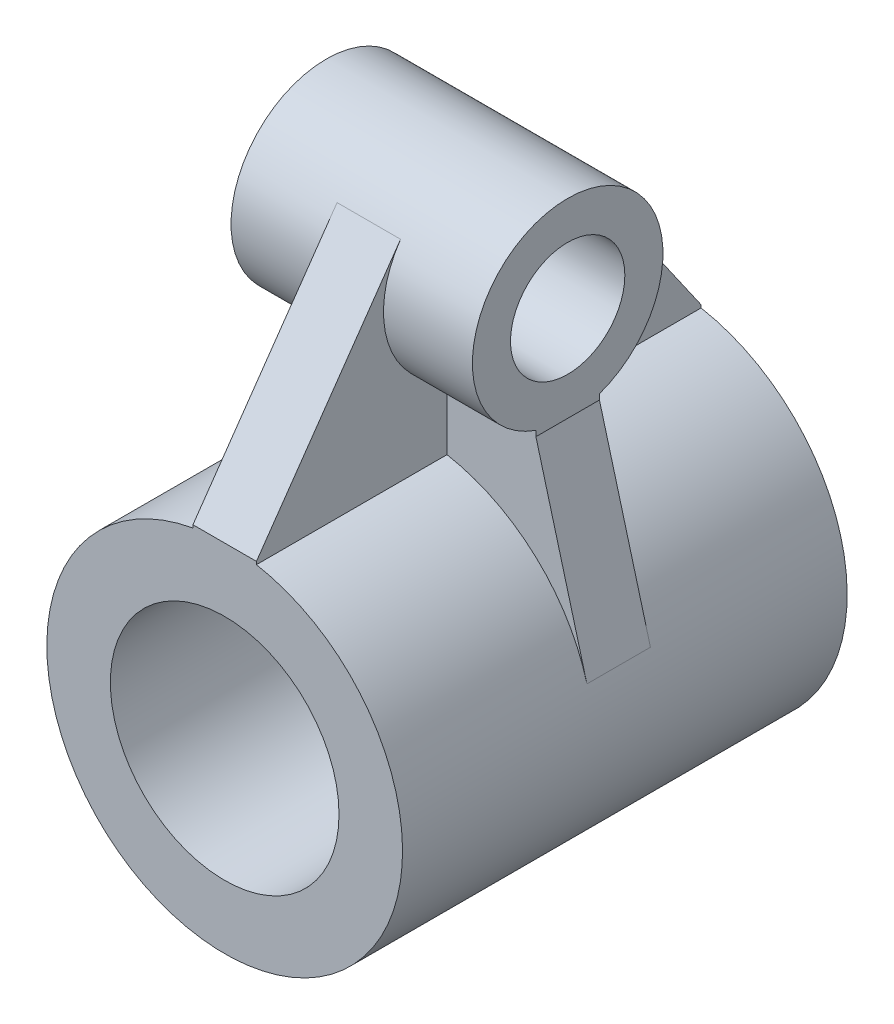
ISO-10303-21;
HEADER;
FILE_DESCRIPTION(('STEP AP214'),'2;1');
FILE_NAME('part.step','',(''),(''),'','','');
FILE_SCHEMA(('AUTOMOTIVE_DESIGN { 1 0 10303 214 1 1 1 1 }'));
ENDSEC;
DATA;
#1=APPLICATION_CONTEXT('core data for automotive mechanical design processes');
#2=APPLICATION_PROTOCOL_DEFINITION('international standard','automotive_design',2000,#1);
#3=PRODUCT_CONTEXT('',#1,'mechanical');
#4=PRODUCT('Part','Part','',(#3));
#5=PRODUCT_RELATED_PRODUCT_CATEGORY('part','',(#4));
#6=PRODUCT_DEFINITION_FORMATION('','',#4);
#7=PRODUCT_DEFINITION_CONTEXT('part definition',#1,'design');
#8=PRODUCT_DEFINITION('design','',#6,#7);
#9=PRODUCT_DEFINITION_SHAPE('','',#8);
#10=(LENGTH_UNIT() NAMED_UNIT(*) SI_UNIT(.MILLI.,.METRE.));
#11=(NAMED_UNIT(*) PLANE_ANGLE_UNIT() SI_UNIT($,.RADIAN.));
#12=(NAMED_UNIT(*) SI_UNIT($,.STERADIAN.) SOLID_ANGLE_UNIT());
#13=UNCERTAINTY_MEASURE_WITH_UNIT(LENGTH_MEASURE(1.E-05),#10,'distance_accuracy_value','');
#14=(GEOMETRIC_REPRESENTATION_CONTEXT(3) GLOBAL_UNCERTAINTY_ASSIGNED_CONTEXT((#13)) GLOBAL_UNIT_ASSIGNED_CONTEXT((#10,
#11,#12)) REPRESENTATION_CONTEXT('',''));
#15=CARTESIAN_POINT('',(0.,0.,0.));
#16=DIRECTION('',(0.,0.,1.));
#17=DIRECTION('',(1.,0.,0.));
#18=AXIS2_PLACEMENT_3D('',#15,#16,#17);
#19=CARTESIAN_POINT('',(2.5,26.,0.));
#20=DIRECTION('',(1.,0.,0.));
#21=DIRECTION('',(0.,0.,-1.));
#22=AXIS2_PLACEMENT_3D('',#19,#20,#21);
#23=PLANE('',#22);
#24=CARTESIAN_POINT('',(2.5,26.,0.));
#25=DIRECTION('',(-1.,0.,0.));
#26=DIRECTION('',(0.,0.,-1.));
#27=AXIS2_PLACEMENT_3D('',#24,#25,#26);
#28=CIRCLE('',#27,7.49999999999999);
#29=CARTESIAN_POINT('',(2.5,30.2870363418499,-6.15396777726847));
#30=VERTEX_POINT('',#29);
#31=CARTESIAN_POINT('',(2.5,18.9289321881345,-2.5));
#32=VERTEX_POINT('',#31);
#33=EDGE_CURVE('E227',#30,#32,#28,.T.);
#34=ORIENTED_EDGE('',*,*,#33,.T.);
#35=DIRECTION('',(0.,-1.,0.));
#36=VECTOR('',#35,1.);
#37=CARTESIAN_POINT('',(2.5,26.,-2.5));
#38=LINE('',#37,#36);
#39=CARTESIAN_POINT('',(2.5,13.7749773139559,-2.5));
#40=VERTEX_POINT('',#39);
#41=EDGE_CURVE('E160',#32,#40,#38,.T.);
#42=ORIENTED_EDGE('',*,*,#41,.T.);
#43=DIRECTION('',(0.,0.,-1.));
#44=VECTOR('',#43,1.);
#45=CARTESIAN_POINT('',(2.5,13.7749773139559,17.5));
#46=LINE('',#45,#44);
#47=CARTESIAN_POINT('',(2.5,13.7749773139559,-17.5));
#48=VERTEX_POINT('',#47);
#49=EDGE_CURVE('E271',#48,#40,#46,.F.);
#50=ORIENTED_EDGE('',*,*,#49,.F.);
#51=DIRECTION('',(0.,1.,0.));
#52=VECTOR('',#51,1.);
#53=CARTESIAN_POINT('',(2.5,14.,-17.5));
#54=LINE('',#53,#52);
#55=CARTESIAN_POINT('',(2.5,14.,-17.5));
#56=VERTEX_POINT('',#55);
#57=EDGE_CURVE('E220',#48,#56,#54,.T.);
#58=ORIENTED_EDGE('',*,*,#57,.T.);
#59=DIRECTION('',(0.,0.820529036969129,0.571604845579981));
#60=VECTOR('',#59,1.);
#61=CARTESIAN_POINT('',(2.5,14.,-17.5));
#62=LINE('',#61,#60);
#63=EDGE_CURVE('E223',#56,#30,#62,.T.);
#64=ORIENTED_EDGE('',*,*,#63,.T.);
#65=EDGE_LOOP('',(#34,#42,#50,#58,#64));
#66=FACE_BOUND('',#65,.T.);
#67=ADVANCED_FACE('F39',(#66),#23,.T.);
#68=CARTESIAN_POINT('',(-2.5,26.,0.));
#69=DIRECTION('',(1.,0.,0.));
#70=DIRECTION('',(0.,0.,-1.));
#71=AXIS2_PLACEMENT_3D('',#68,#69,#70);
#72=PLANE('',#71);
#73=DIRECTION('',(0.,-1.,0.));
#74=VECTOR('',#73,1.);
#75=CARTESIAN_POINT('',(-2.5,26.,-2.5));
#76=LINE('',#75,#74);
#77=CARTESIAN_POINT('',(-2.5,18.9289321881345,-2.5));
#78=VERTEX_POINT('',#77);
#79=CARTESIAN_POINT('',(-2.5,13.7749773139559,-2.5));
#80=VERTEX_POINT('',#79);
#81=EDGE_CURVE('E200',#78,#80,#76,.T.);
#82=ORIENTED_EDGE('',*,*,#81,.F.);
#83=CARTESIAN_POINT('',(-2.5,26.,0.));
#84=DIRECTION('',(-1.,0.,0.));
#85=DIRECTION('',(0.,0.,-1.));
#86=AXIS2_PLACEMENT_3D('',#83,#84,#85);
#87=CIRCLE('',#86,7.49999999999999);
#88=CARTESIAN_POINT('',(-2.5,30.2870363418499,-6.15396777726847));
#89=VERTEX_POINT('',#88);
#90=EDGE_CURVE('E243',#89,#78,#87,.T.);
#91=ORIENTED_EDGE('',*,*,#90,.F.);
#92=DIRECTION('',(0.,0.820529036969129,0.571604845579981));
#93=VECTOR('',#92,1.);
#94=CARTESIAN_POINT('',(-2.5,14.,-17.5));
#95=LINE('',#94,#93);
#96=CARTESIAN_POINT('',(-2.5,14.,-17.5));
#97=VERTEX_POINT('',#96);
#98=EDGE_CURVE('E239',#97,#89,#95,.T.);
#99=ORIENTED_EDGE('',*,*,#98,.F.);
#100=DIRECTION('',(0.,1.,0.));
#101=VECTOR('',#100,1.);
#102=CARTESIAN_POINT('',(-2.5,14.,-17.5));
#103=LINE('',#102,#101);
#104=CARTESIAN_POINT('',(-2.5,13.7749773139559,-17.5));
#105=VERTEX_POINT('',#104);
#106=EDGE_CURVE('E236',#105,#97,#103,.T.);
#107=ORIENTED_EDGE('',*,*,#106,.F.);
#108=DIRECTION('',(0.,0.,-1.));
#109=VECTOR('',#108,1.);
#110=CARTESIAN_POINT('',(-2.5,13.7749773139559,17.5));
#111=LINE('',#110,#109);
#112=EDGE_CURVE('E267',#105,#80,#111,.F.);
#113=ORIENTED_EDGE('',*,*,#112,.T.);
#114=EDGE_LOOP('',(#82,#91,#99,#107,#113));
#115=FACE_BOUND('',#114,.T.);
#116=ADVANCED_FACE('F313',(#115),#72,.F.);
#117=CARTESIAN_POINT('',(0.,0.,17.5));
#118=DIRECTION('',(0.,0.,1.));
#119=DIRECTION('',(1.,0.,0.));
#120=AXIS2_PLACEMENT_3D('',#117,#118,#119);
#121=PLANE('',#120);
#122=CARTESIAN_POINT('',(0.,0.,17.5));
#123=DIRECTION('',(0.,0.,1.));
#124=DIRECTION('',(1.,0.,0.));
#125=AXIS2_PLACEMENT_3D('',#122,#123,#124);
#126=CIRCLE('',#125,9.00000000000001);
#127=CARTESIAN_POINT('',(9.00000000000001,0.,17.5));
#128=VERTEX_POINT('',#127);
#129=EDGE_CURVE('E256',#128,#128,#126,.T.);
#130=ORIENTED_EDGE('',*,*,#129,.F.);
#131=EDGE_LOOP('',(#130));
#132=FACE_BOUND('',#131,.T.);
#133=CARTESIAN_POINT('',(0.,0.,17.5));
#134=DIRECTION('',(0.,0.,1.));
#135=DIRECTION('',(1.,0.,0.));
#136=AXIS2_PLACEMENT_3D('',#133,#134,#135);
#137=CIRCLE('',#136,14.);
#138=CARTESIAN_POINT('',(-2.5,13.7749773139559,17.5));
#139=VERTEX_POINT('',#138);
#140=CARTESIAN_POINT('',(2.5,13.7749773139559,17.5));
#141=VERTEX_POINT('',#140);
#142=EDGE_CURVE('E262',#139,#141,#137,.T.);
#143=ORIENTED_EDGE('',*,*,#142,.T.);
#144=DIRECTION('',(0.,-1.,0.));
#145=VECTOR('',#144,1.);
#146=CARTESIAN_POINT('',(2.5,9.00000000000001,17.5));
#147=LINE('',#146,#145);
#148=CARTESIAN_POINT('',(2.5,14.,17.5));
#149=VERTEX_POINT('',#148);
#150=EDGE_CURVE('E217',#149,#141,#147,.T.);
#151=ORIENTED_EDGE('',*,*,#150,.F.);
#152=DIRECTION('',(-1.,0.,0.));
#153=VECTOR('',#152,1.);
#154=CARTESIAN_POINT('',(2.5,14.,17.5));
#155=LINE('',#154,#153);
#156=CARTESIAN_POINT('',(-2.5,14.,17.5));
#157=VERTEX_POINT('',#156);
#158=EDGE_CURVE('E233',#149,#157,#155,.T.);
#159=ORIENTED_EDGE('',*,*,#158,.T.);
#160=DIRECTION('',(0.,-1.,0.));
#161=VECTOR('',#160,1.);
#162=CARTESIAN_POINT('',(-2.5,9.00000000000001,17.5));
#163=LINE('',#162,#161);
#164=EDGE_CURVE('E215',#157,#139,#163,.T.);
#165=ORIENTED_EDGE('',*,*,#164,.T.);
#166=EDGE_LOOP('',(#143,#151,#159,#165));
#167=FACE_BOUND('',#166,.T.);
#168=ADVANCED_FACE('F291',(#132,#167),#121,.T.);
#169=CARTESIAN_POINT('',(0.,0.,-17.5));
#170=DIRECTION('',(0.,0.,1.));
#171=DIRECTION('',(1.,0.,0.));
#172=AXIS2_PLACEMENT_3D('',#169,#170,#171);
#173=PLANE('',#172);
#174=CARTESIAN_POINT('',(0.,0.,-17.5));
#175=DIRECTION('',(0.,0.,1.));
#176=DIRECTION('',(1.,0.,0.));
#177=AXIS2_PLACEMENT_3D('',#174,#175,#176);
#178=CIRCLE('',#177,9.00000000000001);
#179=CARTESIAN_POINT('',(9.00000000000001,0.,-17.5));
#180=VERTEX_POINT('',#179);
#181=EDGE_CURVE('E255',#180,#180,#178,.T.);
#182=ORIENTED_EDGE('',*,*,#181,.T.);
#183=EDGE_LOOP('',(#182));
#184=FACE_BOUND('',#183,.T.);
#185=ORIENTED_EDGE('',*,*,#57,.F.);
#186=CARTESIAN_POINT('',(0.,0.,-17.5));
#187=DIRECTION('',(0.,0.,1.));
#188=DIRECTION('',(1.,0.,0.));
#189=AXIS2_PLACEMENT_3D('',#186,#187,#188);
#190=CIRCLE('',#189,14.);
#191=EDGE_CURVE('E259',#105,#48,#190,.T.);
#192=ORIENTED_EDGE('',*,*,#191,.F.);
#193=ORIENTED_EDGE('',*,*,#106,.T.);
#194=DIRECTION('',(-1.,0.,0.));
#195=VECTOR('',#194,1.);
#196=CARTESIAN_POINT('',(2.5,14.,-17.5));
#197=LINE('',#196,#195);
#198=EDGE_CURVE('E253',#56,#97,#197,.T.);
#199=ORIENTED_EDGE('',*,*,#198,.F.);
#200=EDGE_LOOP('',(#185,#192,#193,#199));
#201=FACE_BOUND('',#200,.T.);
#202=ADVANCED_FACE('F350',(#184,#201),#173,.F.);
#203=CARTESIAN_POINT('',(0.,0.,17.5));
#204=DIRECTION('',(0.,0.,-1.));
#205=DIRECTION('',(-1.,0.,0.));
#206=AXIS2_PLACEMENT_3D('',#203,#204,#205);
#207=CYLINDRICAL_SURFACE('',#206,14.);
#208=DIRECTION('',(0.,0.,-1.));
#209=VECTOR('',#208,1.);
#210=CARTESIAN_POINT('',(13.5145575336428,3.65468667191319,2.5));
#211=LINE('',#210,#209);
#212=CARTESIAN_POINT('',(13.5145575336428,3.65468667191319,2.5));
#213=VERTEX_POINT('',#212);
#214=CARTESIAN_POINT('',(13.5145575336428,3.65468667191319,-2.5));
#215=VERTEX_POINT('',#214);
#216=EDGE_CURVE('E54',#213,#215,#211,.T.);
#217=ORIENTED_EDGE('',*,*,#216,.F.);
#218=CARTESIAN_POINT('',(0.,0.,2.5));
#219=DIRECTION('',(0.,0.,-1.));
#220=DIRECTION('',(1.,0.,0.));
#221=AXIS2_PLACEMENT_3D('',#218,#219,#220);
#222=CIRCLE('',#221,14.);
#223=CARTESIAN_POINT('',(2.5,13.7749773139559,2.5));
#224=VERTEX_POINT('',#223);
#225=EDGE_CURVE('E174',#224,#213,#222,.T.);
#226=ORIENTED_EDGE('',*,*,#225,.F.);
#227=EDGE_CURVE('E270',#224,#141,#46,.F.);
#228=ORIENTED_EDGE('',*,*,#227,.T.);
#229=ORIENTED_EDGE('',*,*,#142,.F.);
#230=CARTESIAN_POINT('',(-2.5,13.7749773139559,2.5));
#231=VERTEX_POINT('',#230);
#232=EDGE_CURVE('E265',#231,#139,#111,.F.);
#233=ORIENTED_EDGE('',*,*,#232,.F.);
#234=CARTESIAN_POINT('',(-13.5145575336428,3.6546866719132,2.5));
#235=VERTEX_POINT('',#234);
#236=EDGE_CURVE('E183',#235,#231,#222,.T.);
#237=ORIENTED_EDGE('',*,*,#236,.F.);
#238=DIRECTION('',(0.,0.,-1.));
#239=VECTOR('',#238,1.);
#240=CARTESIAN_POINT('',(-13.5145575336428,3.65468667191319,2.5));
#241=LINE('',#240,#239);
#242=CARTESIAN_POINT('',(-13.5145575336428,3.65468667191319,-2.5));
#243=VERTEX_POINT('',#242);
#244=EDGE_CURVE('E196',#235,#243,#241,.T.);
#245=ORIENTED_EDGE('',*,*,#244,.T.);
#246=CARTESIAN_POINT('',(0.,0.,-2.5));
#247=DIRECTION('',(0.,0.,-1.));
#248=DIRECTION('',(1.,0.,0.));
#249=AXIS2_PLACEMENT_3D('',#246,#247,#248);
#250=CIRCLE('',#249,14.);
#251=EDGE_CURVE('E175',#243,#80,#250,.T.);
#252=ORIENTED_EDGE('',*,*,#251,.T.);
#253=ORIENTED_EDGE('',*,*,#112,.F.);
#254=ORIENTED_EDGE('',*,*,#191,.T.);
#255=ORIENTED_EDGE('',*,*,#49,.T.);
#256=EDGE_CURVE('E59',#40,#215,#250,.T.);
#257=ORIENTED_EDGE('',*,*,#256,.T.);
#258=EDGE_LOOP('',(#217,#226,#228,#229,#233,#237,#245,#252,#253,#254,#255,#257));
#259=FACE_BOUND('',#258,.T.);
#260=ADVANCED_FACE('F41',(#259),#207,.T.);
#261=CARTESIAN_POINT('',(0.,0.,17.5));
#262=DIRECTION('',(0.,0.,-1.));
#263=DIRECTION('',(-1.,0.,0.));
#264=AXIS2_PLACEMENT_3D('',#261,#262,#263);
#265=CYLINDRICAL_SURFACE('',#264,9.00000000000001);
#266=ORIENTED_EDGE('',*,*,#181,.F.);
#267=EDGE_LOOP('',(#266));
#268=FACE_BOUND('',#267,.T.);
#269=ORIENTED_EDGE('',*,*,#129,.T.);
#270=EDGE_LOOP('',(#269));
#271=FACE_BOUND('',#270,.T.);
#272=ADVANCED_FACE('F337',(#268,#271),#265,.F.);
#273=DIRECTION('',(0.,-1.,0.));
#274=VECTOR('',#273,1.);
#275=CARTESIAN_POINT('',(2.5,26.,2.5));
#276=LINE('',#275,#274);
#277=CARTESIAN_POINT('',(2.5,18.9289321881345,2.5));
#278=VERTEX_POINT('',#277);
#279=EDGE_CURVE('E203',#278,#224,#276,.T.);
#280=ORIENTED_EDGE('',*,*,#279,.F.);
#281=CARTESIAN_POINT('',(2.5,30.2870363418499,6.15396777726847));
#282=VERTEX_POINT('',#281);
#283=EDGE_CURVE('E226',#278,#282,#28,.T.);
#284=ORIENTED_EDGE('',*,*,#283,.T.);
#285=DIRECTION('',(0.,-0.820529036969129,0.571604845579981));
#286=VECTOR('',#285,1.);
#287=CARTESIAN_POINT('',(2.5,14.,17.5));
#288=LINE('',#287,#286);
#289=EDGE_CURVE('E230',#282,#149,#288,.T.);
#290=ORIENTED_EDGE('',*,*,#289,.T.);
#291=ORIENTED_EDGE('',*,*,#150,.T.);
#292=ORIENTED_EDGE('',*,*,#227,.F.);
#293=EDGE_LOOP('',(#280,#284,#290,#291,#292));
#294=FACE_BOUND('',#293,.T.);
#295=ADVANCED_FACE('F286',(#294),#23,.T.);
#296=CARTESIAN_POINT('',(-2.5,18.9289321881345,2.5));
#297=VERTEX_POINT('',#296);
#298=CARTESIAN_POINT('',(-2.5,30.2870363418498,6.15396777726846));
#299=VERTEX_POINT('',#298);
#300=EDGE_CURVE('E242',#297,#299,#87,.T.);
#301=ORIENTED_EDGE('',*,*,#300,.F.);
#302=DIRECTION('',(0.,-1.,0.));
#303=VECTOR('',#302,1.);
#304=CARTESIAN_POINT('',(-2.5,26.,2.5));
#305=LINE('',#304,#303);
#306=EDGE_CURVE('E205',#297,#231,#305,.T.);
#307=ORIENTED_EDGE('',*,*,#306,.T.);
#308=ORIENTED_EDGE('',*,*,#232,.T.);
#309=ORIENTED_EDGE('',*,*,#164,.F.);
#310=DIRECTION('',(0.,-0.820529036969129,0.571604845579981));
#311=VECTOR('',#310,1.);
#312=CARTESIAN_POINT('',(-2.5,14.,17.5));
#313=LINE('',#312,#311);
#314=EDGE_CURVE('E221',#299,#157,#313,.T.);
#315=ORIENTED_EDGE('',*,*,#314,.F.);
#316=EDGE_LOOP('',(#301,#307,#308,#309,#315));
#317=FACE_BOUND('',#316,.T.);
#318=ADVANCED_FACE('F296',(#317),#72,.F.);
#319=CARTESIAN_POINT('',(2.5,14.,-17.5));
#320=DIRECTION('',(0.,-0.571604845579981,0.820529036969129));
#321=DIRECTION('',(0.,-0.820529036969129,-0.571604845579981));
#322=AXIS2_PLACEMENT_3D('',#319,#320,#321);
#323=PLANE('',#322);
#324=ORIENTED_EDGE('',*,*,#98,.T.);
#325=DIRECTION('',(-1.,0.,0.));
#326=VECTOR('',#325,1.);
#327=CARTESIAN_POINT('',(2.5,30.2870363418499,-6.15396777726846));
#328=LINE('',#327,#326);
#329=EDGE_CURVE('E251',#30,#89,#328,.T.);
#330=ORIENTED_EDGE('',*,*,#329,.F.);
#331=ORIENTED_EDGE('',*,*,#63,.F.);
#332=ORIENTED_EDGE('',*,*,#198,.T.);
#333=EDGE_LOOP('',(#324,#330,#331,#332));
#334=FACE_BOUND('',#333,.T.);
#335=ADVANCED_FACE('F342',(#334),#323,.F.);
#336=CARTESIAN_POINT('',(2.5,14.,17.5));
#337=DIRECTION('',(0.,-0.571604845579981,-0.820529036969129));
#338=DIRECTION('',(0.,0.820529036969129,-0.571604845579981));
#339=AXIS2_PLACEMENT_3D('',#336,#337,#338);
#340=PLANE('',#339);
#341=ORIENTED_EDGE('',*,*,#314,.T.);
#342=ORIENTED_EDGE('',*,*,#158,.F.);
#343=ORIENTED_EDGE('',*,*,#289,.F.);
#344=DIRECTION('',(-1.,0.,0.));
#345=VECTOR('',#344,1.);
#346=CARTESIAN_POINT('',(2.5,30.2870363418498,6.15396777726846));
#347=LINE('',#346,#345);
#348=EDGE_CURVE('E248',#282,#299,#347,.T.);
#349=ORIENTED_EDGE('',*,*,#348,.T.);
#350=EDGE_LOOP('',(#341,#342,#343,#349));
#351=FACE_BOUND('',#350,.T.);
#352=ADVANCED_FACE('F368',(#351),#340,.F.);
#353=CARTESIAN_POINT('',(9.5,26.,0.));
#354=DIRECTION('',(1.,0.,0.));
#355=DIRECTION('',(0.,0.,-1.));
#356=AXIS2_PLACEMENT_3D('',#353,#354,#355);
#357=PLANE('',#356);
#358=CARTESIAN_POINT('',(9.5,26.,0.));
#359=DIRECTION('',(1.,0.,0.));
#360=DIRECTION('',(0.,0.,-1.));
#361=AXIS2_PLACEMENT_3D('',#358,#359,#360);
#362=CIRCLE('',#361,4.5);
#363=CARTESIAN_POINT('',(9.5,26.,-4.5));
#364=VERTEX_POINT('',#363);
#365=EDGE_CURVE('E208',#364,#364,#362,.T.);
#366=ORIENTED_EDGE('',*,*,#365,.F.);
#367=EDGE_LOOP('',(#366));
#368=FACE_BOUND('',#367,.T.);
#369=CARTESIAN_POINT('',(9.5,26.,0.));
#370=DIRECTION('',(1.,0.,0.));
#371=DIRECTION('',(0.,0.,-1.));
#372=AXIS2_PLACEMENT_3D('',#369,#370,#371);
#373=CIRCLE('',#372,7.5);
#374=CARTESIAN_POINT('',(9.5,18.9289321881345,-2.5));
#375=VERTEX_POINT('',#374);
#376=CARTESIAN_POINT('',(9.5,18.9289321881345,2.5));
#377=VERTEX_POINT('',#376);
#378=EDGE_CURVE('E167',#375,#377,#373,.T.);
#379=ORIENTED_EDGE('',*,*,#378,.T.);
#380=DIRECTION('',(0.,1.,0.));
#381=VECTOR('',#380,1.);
#382=CARTESIAN_POINT('',(9.5,18.5,2.5));
#383=LINE('',#382,#381);
#384=CARTESIAN_POINT('',(9.5,18.5,2.5));
#385=VERTEX_POINT('',#384);
#386=EDGE_CURVE('E165',#385,#377,#383,.T.);
#387=ORIENTED_EDGE('',*,*,#386,.F.);
#388=DIRECTION('',(0.,0.,-1.));
#389=VECTOR('',#388,1.);
#390=CARTESIAN_POINT('',(9.5,18.5,2.5));
#391=LINE('',#390,#389);
#392=CARTESIAN_POINT('',(9.5,18.5,-2.5));
#393=VERTEX_POINT('',#392);
#394=EDGE_CURVE('E150',#385,#393,#391,.T.);
#395=ORIENTED_EDGE('',*,*,#394,.T.);
#396=DIRECTION('',(0.,1.,0.));
#397=VECTOR('',#396,1.);
#398=CARTESIAN_POINT('',(9.5,18.5,-2.5));
#399=LINE('',#398,#397);
#400=EDGE_CURVE('E187',#393,#375,#399,.T.);
#401=ORIENTED_EDGE('',*,*,#400,.T.);
#402=EDGE_LOOP('',(#379,#387,#395,#401));
#403=FACE_BOUND('',#402,.T.);
#404=ADVANCED_FACE('F166',(#368,#403),#357,.T.);
#405=CARTESIAN_POINT('',(-9.5,26.,0.));
#406=DIRECTION('',(1.,0.,0.));
#407=DIRECTION('',(0.,0.,-1.));
#408=AXIS2_PLACEMENT_3D('',#405,#406,#407);
#409=PLANE('',#408);
#410=CARTESIAN_POINT('',(-9.5,26.,0.));
#411=DIRECTION('',(1.,0.,0.));
#412=DIRECTION('',(0.,0.,-1.));
#413=AXIS2_PLACEMENT_3D('',#410,#411,#412);
#414=CIRCLE('',#413,4.5);
#415=CARTESIAN_POINT('',(-9.5,26.,-4.5));
#416=VERTEX_POINT('',#415);
#417=EDGE_CURVE('E207',#416,#416,#414,.T.);
#418=ORIENTED_EDGE('',*,*,#417,.T.);
#419=EDGE_LOOP('',(#418));
#420=FACE_BOUND('',#419,.T.);
#421=DIRECTION('',(0.,-1.,0.));
#422=VECTOR('',#421,1.);
#423=CARTESIAN_POINT('',(-9.50000000000001,21.5,2.5));
#424=LINE('',#423,#422);
#425=CARTESIAN_POINT('',(-9.5,18.9289321881345,2.5));
#426=VERTEX_POINT('',#425);
#427=CARTESIAN_POINT('',(-9.5,18.5,2.5));
#428=VERTEX_POINT('',#427);
#429=EDGE_CURVE('E170',#426,#428,#424,.T.);
#430=ORIENTED_EDGE('',*,*,#429,.F.);
#431=CARTESIAN_POINT('',(-9.5,26.,0.));
#432=DIRECTION('',(1.,0.,0.));
#433=DIRECTION('',(0.,0.,-1.));
#434=AXIS2_PLACEMENT_3D('',#431,#432,#433);
#435=CIRCLE('',#434,7.5);
#436=CARTESIAN_POINT('',(-9.5,18.9289321881345,-2.5));
#437=VERTEX_POINT('',#436);
#438=EDGE_CURVE('E211',#437,#426,#435,.T.);
#439=ORIENTED_EDGE('',*,*,#438,.F.);
#440=DIRECTION('',(0.,-1.,0.));
#441=VECTOR('',#440,1.);
#442=CARTESIAN_POINT('',(-9.50000000000001,21.5,-2.5));
#443=LINE('',#442,#441);
#444=CARTESIAN_POINT('',(-9.5,18.5,-2.5));
#445=VERTEX_POINT('',#444);
#446=EDGE_CURVE('E189',#437,#445,#443,.T.);
#447=ORIENTED_EDGE('',*,*,#446,.T.);
#448=DIRECTION('',(0.,0.,-1.));
#449=VECTOR('',#448,1.);
#450=CARTESIAN_POINT('',(-9.5,18.5,2.5));
#451=LINE('',#450,#449);
#452=EDGE_CURVE('E161',#428,#445,#451,.T.);
#453=ORIENTED_EDGE('',*,*,#452,.F.);
#454=EDGE_LOOP('',(#430,#439,#447,#453));
#455=FACE_BOUND('',#454,.T.);
#456=ADVANCED_FACE('F375',(#420,#455),#409,.F.);
#457=CARTESIAN_POINT('',(9.5,26.,0.));
#458=DIRECTION('',(-1.,0.,0.));
#459=DIRECTION('',(0.,0.,1.));
#460=AXIS2_PLACEMENT_3D('',#457,#458,#459);
#461=CYLINDRICAL_SURFACE('',#460,7.5);
#462=ORIENTED_EDGE('',*,*,#438,.T.);
#463=DIRECTION('',(-1.,0.,0.));
#464=VECTOR('',#463,1.);
#465=CARTESIAN_POINT('',(9.5,18.9289321881345,2.5));
#466=LINE('',#465,#464);
#467=EDGE_CURVE('E11',#426,#297,#466,.F.);
#468=ORIENTED_EDGE('',*,*,#467,.T.);
#469=ORIENTED_EDGE('',*,*,#300,.T.);
#470=ORIENTED_EDGE('',*,*,#348,.F.);
#471=ORIENTED_EDGE('',*,*,#283,.F.);
#472=EDGE_CURVE('E43',#278,#377,#466,.F.);
#473=ORIENTED_EDGE('',*,*,#472,.T.);
#474=ORIENTED_EDGE('',*,*,#378,.F.);
#475=DIRECTION('',(-1.,0.,0.));
#476=VECTOR('',#475,1.);
#477=CARTESIAN_POINT('',(9.5,18.9289321881345,-2.5));
#478=LINE('',#477,#476);
#479=EDGE_CURVE('E272',#32,#375,#478,.F.);
#480=ORIENTED_EDGE('',*,*,#479,.F.);
#481=ORIENTED_EDGE('',*,*,#33,.F.);
#482=ORIENTED_EDGE('',*,*,#329,.T.);
#483=ORIENTED_EDGE('',*,*,#90,.T.);
#484=EDGE_CURVE('E274',#437,#78,#478,.F.);
#485=ORIENTED_EDGE('',*,*,#484,.F.);
#486=EDGE_LOOP('',(#462,#468,#469,#470,#471,#473,#474,#480,#481,#482,#483,#485));
#487=FACE_BOUND('',#486,.T.);
#488=ADVANCED_FACE('F282',(#487),#461,.T.);
#489=CARTESIAN_POINT('',(9.5,26.,0.));
#490=DIRECTION('',(-1.,0.,0.));
#491=DIRECTION('',(0.,0.,1.));
#492=AXIS2_PLACEMENT_3D('',#489,#490,#491);
#493=CYLINDRICAL_SURFACE('',#492,4.5);
#494=ORIENTED_EDGE('',*,*,#417,.F.);
#495=EDGE_LOOP('',(#494));
#496=FACE_BOUND('',#495,.T.);
#497=ORIENTED_EDGE('',*,*,#365,.T.);
#498=EDGE_LOOP('',(#497));
#499=FACE_BOUND('',#498,.T.);
#500=ADVANCED_FACE('F387',(#496,#499),#493,.F.);
#501=CARTESIAN_POINT('',(0.,0.,2.5));
#502=DIRECTION('',(0.,0.,1.));
#503=DIRECTION('',(1.,0.,0.));
#504=AXIS2_PLACEMENT_3D('',#501,#502,#503);
#505=PLANE('',#504);
#506=ORIENTED_EDGE('',*,*,#472,.F.);
#507=ORIENTED_EDGE('',*,*,#279,.T.);
#508=ORIENTED_EDGE('',*,*,#225,.T.);
#509=DIRECTION('',(-0.261049047993799,0.965325538117339,0.));
#510=VECTOR('',#509,1.);
#511=CARTESIAN_POINT('',(9.5,18.5,2.5));
#512=LINE('',#511,#510);
#513=EDGE_CURVE('E154',#213,#385,#512,.T.);
#514=ORIENTED_EDGE('',*,*,#513,.T.);
#515=ORIENTED_EDGE('',*,*,#386,.T.);
#516=EDGE_LOOP('',(#506,#507,#508,#514,#515));
#517=FACE_BOUND('',#516,.T.);
#518=ADVANCED_FACE('F172',(#517),#505,.T.);
#519=CARTESIAN_POINT('',(0.,0.,-2.5));
#520=DIRECTION('',(0.,0.,1.));
#521=DIRECTION('',(1.,0.,0.));
#522=AXIS2_PLACEMENT_3D('',#519,#520,#521);
#523=PLANE('',#522);
#524=ORIENTED_EDGE('',*,*,#41,.F.);
#525=ORIENTED_EDGE('',*,*,#479,.T.);
#526=ORIENTED_EDGE('',*,*,#400,.F.);
#527=DIRECTION('',(-0.261049047993799,0.965325538117339,0.));
#528=VECTOR('',#527,1.);
#529=CARTESIAN_POINT('',(9.5,18.5,-2.5));
#530=LINE('',#529,#528);
#531=EDGE_CURVE('E156',#215,#393,#530,.T.);
#532=ORIENTED_EDGE('',*,*,#531,.F.);
#533=ORIENTED_EDGE('',*,*,#256,.F.);
#534=EDGE_LOOP('',(#524,#525,#526,#532,#533));
#535=FACE_BOUND('',#534,.T.);
#536=ADVANCED_FACE('F319',(#535),#523,.F.);
#537=CARTESIAN_POINT('',(9.5,18.5,2.5));
#538=DIRECTION('',(-0.965325538117339,-0.261049047993799,0.));
#539=DIRECTION('',(0.261049047993799,-0.96532553811734,0.));
#540=AXIS2_PLACEMENT_3D('',#537,#538,#539);
#541=PLANE('',#540);
#542=ORIENTED_EDGE('',*,*,#531,.T.);
#543=ORIENTED_EDGE('',*,*,#394,.F.);
#544=ORIENTED_EDGE('',*,*,#513,.F.);
#545=ORIENTED_EDGE('',*,*,#216,.T.);
#546=EDGE_LOOP('',(#542,#543,#544,#545));
#547=FACE_BOUND('',#546,.T.);
#548=ADVANCED_FACE('F152',(#547),#541,.F.);
#549=ORIENTED_EDGE('',*,*,#306,.F.);
#550=ORIENTED_EDGE('',*,*,#467,.F.);
#551=ORIENTED_EDGE('',*,*,#429,.T.);
#552=DIRECTION('',(-0.261049047993799,-0.965325538117339,0.));
#553=VECTOR('',#552,1.);
#554=CARTESIAN_POINT('',(-9.5,18.5,2.5));
#555=LINE('',#554,#553);
#556=EDGE_CURVE('E180',#428,#235,#555,.T.);
#557=ORIENTED_EDGE('',*,*,#556,.T.);
#558=ORIENTED_EDGE('',*,*,#236,.T.);
#559=EDGE_LOOP('',(#549,#550,#551,#557,#558));
#560=FACE_BOUND('',#559,.T.);
#561=ADVANCED_FACE('F299',(#560),#505,.T.);
#562=ORIENTED_EDGE('',*,*,#484,.T.);
#563=ORIENTED_EDGE('',*,*,#81,.T.);
#564=ORIENTED_EDGE('',*,*,#251,.F.);
#565=DIRECTION('',(-0.261049047993799,-0.965325538117339,0.));
#566=VECTOR('',#565,1.);
#567=CARTESIAN_POINT('',(-9.5,18.5,-2.5));
#568=LINE('',#567,#566);
#569=EDGE_CURVE('E192',#445,#243,#568,.T.);
#570=ORIENTED_EDGE('',*,*,#569,.F.);
#571=ORIENTED_EDGE('',*,*,#446,.F.);
#572=EDGE_LOOP('',(#562,#563,#564,#570,#571));
#573=FACE_BOUND('',#572,.T.);
#574=ADVANCED_FACE('F316',(#573),#523,.F.);
#575=CARTESIAN_POINT('',(-9.5,18.5,2.5));
#576=DIRECTION('',(0.965325538117339,-0.261049047993799,0.));
#577=DIRECTION('',(0.261049047993799,0.96532553811734,0.));
#578=AXIS2_PLACEMENT_3D('',#575,#576,#577);
#579=PLANE('',#578);
#580=ORIENTED_EDGE('',*,*,#569,.T.);
#581=ORIENTED_EDGE('',*,*,#244,.F.);
#582=ORIENTED_EDGE('',*,*,#556,.F.);
#583=ORIENTED_EDGE('',*,*,#452,.T.);
#584=EDGE_LOOP('',(#580,#581,#582,#583));
#585=FACE_BOUND('',#584,.T.);
#586=ADVANCED_FACE('F306',(#585),#579,.F.);
#587=CLOSED_SHELL('',(#67,#116,#168,#202,#260,#272,#295,#318,#335,#352,#404,#456,#488,#500,#518,
#536,#548,#561,#574,#586));
#588=MANIFOLD_SOLID_BREP('B2',#587);
#589=ADVANCED_BREP_SHAPE_REPRESENTATION('',(#18,#588),#14);
#590=SHAPE_DEFINITION_REPRESENTATION(#9,#589);
ENDSEC;
END-ISO-10303-21;
